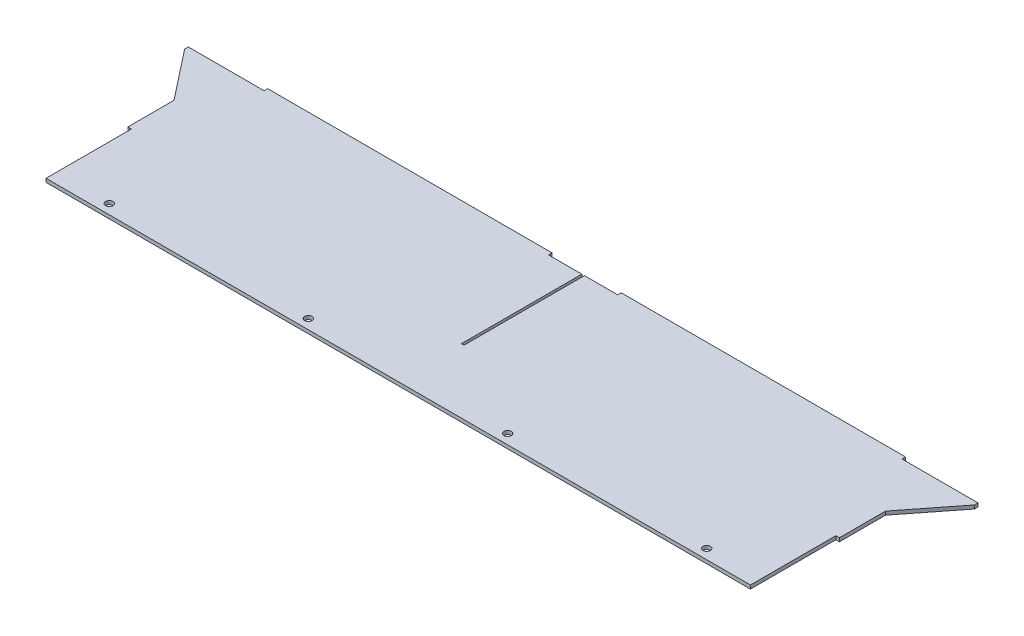
ISO-10303-21;
HEADER;
FILE_DESCRIPTION(('STEP AP214'),'2;1');
FILE_NAME('part.step','',(''),(''),'','','');
FILE_SCHEMA(('AUTOMOTIVE_DESIGN { 1 0 10303 214 1 1 1 1 }'));
ENDSEC;
DATA;
#1=APPLICATION_CONTEXT('core data for automotive mechanical design processes');
#2=APPLICATION_PROTOCOL_DEFINITION('international standard','automotive_design',2000,#1);
#3=PRODUCT_CONTEXT('',#1,'mechanical');
#4=PRODUCT('Part','Part','',(#3));
#5=PRODUCT_RELATED_PRODUCT_CATEGORY('part','',(#4));
#6=PRODUCT_DEFINITION_FORMATION('','',#4);
#7=PRODUCT_DEFINITION_CONTEXT('part definition',#1,'design');
#8=PRODUCT_DEFINITION('design','',#6,#7);
#9=PRODUCT_DEFINITION_SHAPE('','',#8);
#10=(LENGTH_UNIT() NAMED_UNIT(*) SI_UNIT(.MILLI.,.METRE.));
#11=(NAMED_UNIT(*) PLANE_ANGLE_UNIT() SI_UNIT($,.RADIAN.));
#12=(NAMED_UNIT(*) SI_UNIT($,.STERADIAN.) SOLID_ANGLE_UNIT());
#13=UNCERTAINTY_MEASURE_WITH_UNIT(LENGTH_MEASURE(1.E-05),#10,'distance_accuracy_value','');
#14=(GEOMETRIC_REPRESENTATION_CONTEXT(3) GLOBAL_UNCERTAINTY_ASSIGNED_CONTEXT((#13)) GLOBAL_UNIT_ASSIGNED_CONTEXT((#10,
#11,#12)) REPRESENTATION_CONTEXT('',''));
#15=CARTESIAN_POINT('',(0.,0.,0.));
#16=DIRECTION('',(0.,0.,1.));
#17=DIRECTION('',(1.,0.,0.));
#18=AXIS2_PLACEMENT_3D('',#15,#16,#17);
#19=CARTESIAN_POINT('',(-266.7,1.5875,73.8124000000001));
#20=DIRECTION('',(0.,1.,0.));
#21=DIRECTION('',(0.,0.,1.));
#22=AXIS2_PLACEMENT_3D('',#19,#20,#21);
#23=CYLINDRICAL_SURFACE('',#22,3.3);
#24=CARTESIAN_POINT('',(-266.7,-1.58750000000007,73.8124000000001));
#25=DIRECTION('',(0.,1.,0.));
#26=DIRECTION('',(0.,0.,1.));
#27=AXIS2_PLACEMENT_3D('',#24,#25,#26);
#28=CIRCLE('',#27,3.30000000000003);
#29=CARTESIAN_POINT('',(-266.7,-1.58750000000007,77.1124000000001));
#30=VERTEX_POINT('',#29);
#31=EDGE_CURVE('E43',#30,#30,#28,.T.);
#32=ORIENTED_EDGE('',*,*,#31,.F.);
#33=EDGE_LOOP('',(#32));
#34=FACE_BOUND('',#33,.T.);
#35=CARTESIAN_POINT('',(-266.7,1.5875,73.8124000000001));
#36=DIRECTION('',(0.,1.,0.));
#37=DIRECTION('',(0.,0.,1.));
#38=AXIS2_PLACEMENT_3D('',#35,#36,#37);
#39=CIRCLE('',#38,3.29999999999997);
#40=CARTESIAN_POINT('',(-266.7,1.5875,77.1124000000001));
#41=VERTEX_POINT('',#40);
#42=EDGE_CURVE('E11',#41,#41,#39,.T.);
#43=ORIENTED_EDGE('',*,*,#42,.T.);
#44=EDGE_LOOP('',(#43));
#45=FACE_BOUND('',#44,.T.);
#46=ADVANCED_FACE('F36',(#34,#45),#23,.F.);
#47=CARTESIAN_POINT('',(-88.8999999999999,1.5875,73.8124000000001));
#48=DIRECTION('',(0.,1.,0.));
#49=DIRECTION('',(0.,0.,1.));
#50=AXIS2_PLACEMENT_3D('',#47,#48,#49);
#51=CYLINDRICAL_SURFACE('',#50,3.3);
#52=CARTESIAN_POINT('',(-88.8999999999999,-1.58750000000007,73.8124000000001));
#53=DIRECTION('',(0.,1.,0.));
#54=DIRECTION('',(0.,0.,1.));
#55=AXIS2_PLACEMENT_3D('',#52,#53,#54);
#56=CIRCLE('',#55,3.30000000000003);
#57=CARTESIAN_POINT('',(-88.8999999999999,-1.58750000000007,77.1124000000001));
#58=VERTEX_POINT('',#57);
#59=EDGE_CURVE('E223',#58,#58,#56,.T.);
#60=ORIENTED_EDGE('',*,*,#59,.F.);
#61=EDGE_LOOP('',(#60));
#62=FACE_BOUND('',#61,.T.);
#63=CARTESIAN_POINT('',(-88.8999999999999,1.5875,73.8124000000001));
#64=DIRECTION('',(0.,1.,0.));
#65=DIRECTION('',(0.,0.,1.));
#66=AXIS2_PLACEMENT_3D('',#63,#64,#65);
#67=CIRCLE('',#66,3.29999999999997);
#68=CARTESIAN_POINT('',(-88.8999999999999,1.5875,77.1124000000001));
#69=VERTEX_POINT('',#68);
#70=EDGE_CURVE('E227',#69,#69,#67,.T.);
#71=ORIENTED_EDGE('',*,*,#70,.T.);
#72=EDGE_LOOP('',(#71));
#73=FACE_BOUND('',#72,.T.);
#74=ADVANCED_FACE('F255',(#62,#73),#51,.F.);
#75=CARTESIAN_POINT('',(317.6778,1.5875,-82.55));
#76=DIRECTION('',(-1.,0.,0.));
#77=DIRECTION('',(0.,0.,1.));
#78=AXIS2_PLACEMENT_3D('',#75,#76,#77);
#79=PLANE('',#78);
#80=DIRECTION('',(0.,-1.,0.));
#81=VECTOR('',#80,1.);
#82=CARTESIAN_POINT('',(317.6778,1.5875,6.35000000000007));
#83=LINE('',#82,#81);
#84=CARTESIAN_POINT('',(317.6778,1.5875,6.35000000000007));
#85=VERTEX_POINT('',#84);
#86=CARTESIAN_POINT('',(317.6778,-1.5875,6.35000000000007));
#87=VERTEX_POINT('',#86);
#88=EDGE_CURVE('E692',#85,#87,#83,.T.);
#89=ORIENTED_EDGE('',*,*,#88,.T.);
#90=DIRECTION('',(0.,0.,-1.));
#91=VECTOR('',#90,1.);
#92=CARTESIAN_POINT('',(317.6778,-1.5875,-82.55));
#93=LINE('',#92,#91);
#94=CARTESIAN_POINT('',(317.6778,-1.5875,-34.925));
#95=VERTEX_POINT('',#94);
#96=EDGE_CURVE('E233',#87,#95,#93,.T.);
#97=ORIENTED_EDGE('',*,*,#96,.T.);
#98=DIRECTION('',(0.,-1.,0.));
#99=VECTOR('',#98,1.);
#100=CARTESIAN_POINT('',(317.6778,1.5875,-34.925));
#101=LINE('',#100,#99);
#102=CARTESIAN_POINT('',(317.6778,1.5875,-34.925));
#103=VERTEX_POINT('',#102);
#104=EDGE_CURVE('E657',#103,#95,#101,.T.);
#105=ORIENTED_EDGE('',*,*,#104,.F.);
#106=DIRECTION('',(0.,0.,-1.));
#107=VECTOR('',#106,1.);
#108=CARTESIAN_POINT('',(317.6778,1.5875,-82.55));
#109=LINE('',#108,#107);
#110=EDGE_CURVE('E245',#85,#103,#109,.T.);
#111=ORIENTED_EDGE('',*,*,#110,.F.);
#112=EDGE_LOOP('',(#89,#97,#105,#111));
#113=FACE_BOUND('',#112,.T.);
#114=ADVANCED_FACE('F285',(#113),#79,.F.);
#115=CARTESIAN_POINT('',(-317.6778,1.5875,-82.55));
#116=DIRECTION('',(0.,0.,1.));
#117=DIRECTION('',(1.,0.,0.));
#118=AXIS2_PLACEMENT_3D('',#115,#116,#117);
#119=PLANE('',#118);
#120=DIRECTION('',(0.,-1.,0.));
#121=VECTOR('',#120,1.);
#122=CARTESIAN_POINT('',(-1.14299999999998,1.5875,-82.55));
#123=LINE('',#122,#121);
#124=CARTESIAN_POINT('',(-1.14299999999998,1.5875,-82.55));
#125=VERTEX_POINT('',#124);
#126=CARTESIAN_POINT('',(-1.14299999999998,-1.5875,-82.55));
#127=VERTEX_POINT('',#126);
#128=EDGE_CURVE('E625',#125,#127,#123,.T.);
#129=ORIENTED_EDGE('',*,*,#128,.T.);
#130=DIRECTION('',(-1.,0.,0.));
#131=VECTOR('',#130,1.);
#132=CARTESIAN_POINT('',(-317.6778,-1.5875,-82.55));
#133=LINE('',#132,#131);
#134=CARTESIAN_POINT('',(-30.8229000000015,-1.5875,-82.55));
#135=VERTEX_POINT('',#134);
#136=EDGE_CURVE('E241',#127,#135,#133,.T.);
#137=ORIENTED_EDGE('',*,*,#136,.T.);
#138=DIRECTION('',(0.,-1.,0.));
#139=VECTOR('',#138,1.);
#140=CARTESIAN_POINT('',(-30.8229000000015,-1.58750000000007,-82.55));
#141=LINE('',#140,#139);
#142=CARTESIAN_POINT('',(-30.8229000000015,1.5875,-82.55));
#143=VERTEX_POINT('',#142);
#144=EDGE_CURVE('E551',#143,#135,#141,.T.);
#145=ORIENTED_EDGE('',*,*,#144,.F.);
#146=DIRECTION('',(-1.,0.,0.));
#147=VECTOR('',#146,1.);
#148=CARTESIAN_POINT('',(-317.6778,1.5875,-82.55));
#149=LINE('',#148,#147);
#150=EDGE_CURVE('E567',#125,#143,#149,.T.);
#151=ORIENTED_EDGE('',*,*,#150,.F.);
#152=EDGE_LOOP('',(#129,#137,#145,#151));
#153=FACE_BOUND('',#152,.T.);
#154=ADVANCED_FACE('F268',(#153),#119,.F.);
#155=CARTESIAN_POINT('',(-317.6778,1.5875,82.55));
#156=DIRECTION('',(0.,0.,-1.));
#157=DIRECTION('',(-1.,0.,0.));
#158=AXIS2_PLACEMENT_3D('',#155,#156,#157);
#159=PLANE('',#158);
#160=DIRECTION('',(1.,0.,0.));
#161=VECTOR('',#160,1.);
#162=CARTESIAN_POINT('',(-317.6778,-1.5875,82.55));
#163=LINE('',#162,#161);
#164=CARTESIAN_POINT('',(-314.5028,-1.5875,82.55));
#165=VERTEX_POINT('',#164);
#166=CARTESIAN_POINT('',(314.5028,-1.5875,82.55));
#167=VERTEX_POINT('',#166);
#168=EDGE_CURVE('E244',#165,#167,#163,.T.);
#169=ORIENTED_EDGE('',*,*,#168,.T.);
#170=DIRECTION('',(0.,-1.,0.));
#171=VECTOR('',#170,1.);
#172=CARTESIAN_POINT('',(314.5028,1.5875,82.55));
#173=LINE('',#172,#171);
#174=CARTESIAN_POINT('',(314.5028,1.5875,82.55));
#175=VERTEX_POINT('',#174);
#176=EDGE_CURVE('E222',#175,#167,#173,.T.);
#177=ORIENTED_EDGE('',*,*,#176,.F.);
#178=DIRECTION('',(1.,0.,0.));
#179=VECTOR('',#178,1.);
#180=CARTESIAN_POINT('',(-317.6778,1.5875,82.55));
#181=LINE('',#180,#179);
#182=CARTESIAN_POINT('',(-314.5028,1.5875,82.55));
#183=VERTEX_POINT('',#182);
#184=EDGE_CURVE('E216',#183,#175,#181,.T.);
#185=ORIENTED_EDGE('',*,*,#184,.F.);
#186=DIRECTION('',(0.,-1.,0.));
#187=VECTOR('',#186,1.);
#188=CARTESIAN_POINT('',(-314.5028,1.5875,82.55));
#189=LINE('',#188,#187);
#190=EDGE_CURVE('E197',#183,#165,#189,.T.);
#191=ORIENTED_EDGE('',*,*,#190,.T.);
#192=EDGE_LOOP('',(#169,#177,#185,#191));
#193=FACE_BOUND('',#192,.T.);
#194=ADVANCED_FACE('F221',(#193),#159,.F.);
#195=CARTESIAN_POINT('',(0.,1.5875,0.));
#196=DIRECTION('',(0.,1.,0.));
#197=DIRECTION('',(0.,0.,1.));
#198=AXIS2_PLACEMENT_3D('',#195,#196,#197);
#199=PLANE('',#198);
#200=CARTESIAN_POINT('',(88.9000000000001,1.5875,73.8124000000001));
#201=DIRECTION('',(0.,1.,0.));
#202=DIRECTION('',(0.,0.,1.));
#203=AXIS2_PLACEMENT_3D('',#200,#201,#202);
#204=CIRCLE('',#203,3.29999999999997);
#205=CARTESIAN_POINT('',(88.9000000000001,1.5875,77.1124000000001));
#206=VERTEX_POINT('',#205);
#207=EDGE_CURVE('E725',#206,#206,#204,.T.);
#208=ORIENTED_EDGE('',*,*,#207,.F.);
#209=EDGE_LOOP('',(#208));
#210=FACE_BOUND('',#209,.T.);
#211=CARTESIAN_POINT('',(266.7,1.5875,73.8124000000001));
#212=DIRECTION('',(0.,1.,0.));
#213=DIRECTION('',(0.,0.,1.));
#214=AXIS2_PLACEMENT_3D('',#211,#212,#213);
#215=CIRCLE('',#214,3.29999999999997);
#216=CARTESIAN_POINT('',(266.7,1.5875,77.1124000000001));
#217=VERTEX_POINT('',#216);
#218=EDGE_CURVE('E722',#217,#217,#215,.T.);
#219=ORIENTED_EDGE('',*,*,#218,.F.);
#220=EDGE_LOOP('',(#219));
#221=FACE_BOUND('',#220,.T.);
#222=DIRECTION('',(0.,0.,-1.));
#223=VECTOR('',#222,1.);
#224=CARTESIAN_POINT('',(314.5028,1.5875,0.));
#225=LINE('',#224,#223);
#226=CARTESIAN_POINT('',(314.5028,1.5875,6.35000000000006));
#227=VERTEX_POINT('',#226);
#228=EDGE_CURVE('E697',#175,#227,#225,.T.);
#229=ORIENTED_EDGE('',*,*,#228,.T.);
#230=DIRECTION('',(-1.,0.,0.));
#231=VECTOR('',#230,1.);
#232=CARTESIAN_POINT('',(0.,1.5875,6.34999999999998));
#233=LINE('',#232,#231);
#234=EDGE_CURVE('E699',#85,#227,#233,.T.);
#235=ORIENTED_EDGE('',*,*,#234,.F.);
#236=ORIENTED_EDGE('',*,*,#110,.T.);
#237=DIRECTION('',(-0.617821551931904,0.,0.786318338822422));
#238=VECTOR('',#237,1.);
#239=CARTESIAN_POINT('',(352.6028,1.5875,-79.375));
#240=LINE('',#239,#238);
#241=CARTESIAN_POINT('',(352.6028,1.5875,-79.375));
#242=VERTEX_POINT('',#241);
#243=EDGE_CURVE('E648',#242,#103,#240,.T.);
#244=ORIENTED_EDGE('',*,*,#243,.F.);
#245=DIRECTION('',(0.,0.,1.));
#246=VECTOR('',#245,1.);
#247=CARTESIAN_POINT('',(352.6028,1.5875,-82.55));
#248=LINE('',#247,#246);
#249=CARTESIAN_POINT('',(352.6028,1.5875,-82.55));
#250=VERTEX_POINT('',#249);
#251=EDGE_CURVE('E645',#250,#242,#248,.T.);
#252=ORIENTED_EDGE('',*,*,#251,.F.);
#253=CARTESIAN_POINT('',(284.822900000001,1.5875,-82.55));
#254=VERTEX_POINT('',#253);
#255=EDGE_CURVE('E229',#250,#254,#149,.T.);
#256=ORIENTED_EDGE('',*,*,#255,.T.);
#257=DIRECTION('',(0.,0.,1.));
#258=VECTOR('',#257,1.);
#259=CARTESIAN_POINT('',(284.822900000001,1.58749999999994,-85.725));
#260=LINE('',#259,#258);
#261=CARTESIAN_POINT('',(284.822900000001,1.58749999999994,-85.725));
#262=VERTEX_POINT('',#261);
#263=EDGE_CURVE('E674',#262,#254,#260,.T.);
#264=ORIENTED_EDGE('',*,*,#263,.F.);
#265=DIRECTION('',(1.,0.,0.));
#266=VECTOR('',#265,1.);
#267=CARTESIAN_POINT('',(284.822900000001,1.58749999999994,-85.725));
#268=LINE('',#267,#266);
#269=CARTESIAN_POINT('',(30.8229000000015,1.58749999999994,-85.725));
#270=VERTEX_POINT('',#269);
#271=EDGE_CURVE('E672',#270,#262,#268,.T.);
#272=ORIENTED_EDGE('',*,*,#271,.F.);
#273=DIRECTION('',(0.,0.,1.));
#274=VECTOR('',#273,1.);
#275=CARTESIAN_POINT('',(30.8229000000015,1.58749999999994,-85.725));
#276=LINE('',#275,#274);
#277=CARTESIAN_POINT('',(30.8229000000014,1.5875,-82.55));
#278=VERTEX_POINT('',#277);
#279=EDGE_CURVE('E679',#270,#278,#276,.T.);
#280=ORIENTED_EDGE('',*,*,#279,.T.);
#281=CARTESIAN_POINT('',(1.14300000000002,1.5875,-82.55));
#282=VERTEX_POINT('',#281);
#283=EDGE_CURVE('E566',#278,#282,#149,.T.);
#284=ORIENTED_EDGE('',*,*,#283,.T.);
#285=DIRECTION('',(0.,0.,1.));
#286=VECTOR('',#285,1.);
#287=CARTESIAN_POINT('',(1.14300000000002,1.5875,0.));
#288=LINE('',#287,#286);
#289=CARTESIAN_POINT('',(1.14300000000002,1.5875,24.892));
#290=VERTEX_POINT('',#289);
#291=EDGE_CURVE('E629',#282,#290,#288,.T.);
#292=ORIENTED_EDGE('',*,*,#291,.T.);
#293=DIRECTION('',(1.,0.,0.));
#294=VECTOR('',#293,1.);
#295=CARTESIAN_POINT('',(0.,1.5875,24.892));
#296=LINE('',#295,#294);
#297=CARTESIAN_POINT('',(-1.14299999999998,1.5875,24.892));
#298=VERTEX_POINT('',#297);
#299=EDGE_CURVE('E614',#298,#290,#296,.T.);
#300=ORIENTED_EDGE('',*,*,#299,.F.);
#301=DIRECTION('',(0.,0.,1.));
#302=VECTOR('',#301,1.);
#303=CARTESIAN_POINT('',(-1.14299999999998,1.5875,0.));
#304=LINE('',#303,#302);
#305=EDGE_CURVE('E577',#125,#298,#304,.T.);
#306=ORIENTED_EDGE('',*,*,#305,.F.);
#307=ORIENTED_EDGE('',*,*,#150,.T.);
#308=DIRECTION('',(0.,0.,1.));
#309=VECTOR('',#308,1.);
#310=CARTESIAN_POINT('',(-30.8229000000015,1.58749999999994,-85.725));
#311=LINE('',#310,#309);
#312=CARTESIAN_POINT('',(-30.8229000000015,1.58749999999994,-85.725));
#313=VERTEX_POINT('',#312);
#314=EDGE_CURVE('E557',#313,#143,#311,.T.);
#315=ORIENTED_EDGE('',*,*,#314,.F.);
#316=DIRECTION('',(1.,0.,0.));
#317=VECTOR('',#316,1.);
#318=CARTESIAN_POINT('',(-30.8229000000015,1.58749999999994,-85.725));
#319=LINE('',#318,#317);
#320=CARTESIAN_POINT('',(-284.822900000001,1.58749999999994,-85.725));
#321=VERTEX_POINT('',#320);
#322=EDGE_CURVE('E556',#321,#313,#319,.T.);
#323=ORIENTED_EDGE('',*,*,#322,.F.);
#324=DIRECTION('',(0.,0.,1.));
#325=VECTOR('',#324,1.);
#326=CARTESIAN_POINT('',(-284.822900000001,1.58749999999994,-85.725));
#327=LINE('',#326,#325);
#328=CARTESIAN_POINT('',(-284.822900000001,1.58749999999994,-82.55));
#329=VERTEX_POINT('',#328);
#330=EDGE_CURVE('E545',#321,#329,#327,.T.);
#331=ORIENTED_EDGE('',*,*,#330,.T.);
#332=CARTESIAN_POINT('',(-352.6028,1.5875,-82.55));
#333=VERTEX_POINT('',#332);
#334=EDGE_CURVE('E553',#329,#333,#149,.T.);
#335=ORIENTED_EDGE('',*,*,#334,.T.);
#336=DIRECTION('',(0.,0.,1.));
#337=VECTOR('',#336,1.);
#338=CARTESIAN_POINT('',(-352.6028,1.5875,-82.55));
#339=LINE('',#338,#337);
#340=CARTESIAN_POINT('',(-352.6028,1.5875,-79.375));
#341=VERTEX_POINT('',#340);
#342=EDGE_CURVE('E632',#333,#341,#339,.T.);
#343=ORIENTED_EDGE('',*,*,#342,.T.);
#344=DIRECTION('',(0.617821551931904,0.,0.786318338822422));
#345=VECTOR('',#344,1.);
#346=CARTESIAN_POINT('',(-352.6028,1.5875,-79.375));
#347=LINE('',#346,#345);
#348=CARTESIAN_POINT('',(-317.6778,1.5875,-34.925));
#349=VERTEX_POINT('',#348);
#350=EDGE_CURVE('E630',#341,#349,#347,.T.);
#351=ORIENTED_EDGE('',*,*,#350,.T.);
#352=DIRECTION('',(0.,0.,1.));
#353=VECTOR('',#352,1.);
#354=CARTESIAN_POINT('',(-317.6778,1.5875,-82.55));
#355=LINE('',#354,#353);
#356=CARTESIAN_POINT('',(-317.6778,1.5875,6.34999999999999));
#357=VERTEX_POINT('',#356);
#358=EDGE_CURVE('E224',#349,#357,#355,.T.);
#359=ORIENTED_EDGE('',*,*,#358,.T.);
#360=DIRECTION('',(1.,0.,0.));
#361=VECTOR('',#360,1.);
#362=CARTESIAN_POINT('',(0.,1.5875,6.34999999999999));
#363=LINE('',#362,#361);
#364=CARTESIAN_POINT('',(-314.5028,1.5875,6.34999999999999));
#365=VERTEX_POINT('',#364);
#366=EDGE_CURVE('E208',#357,#365,#363,.T.);
#367=ORIENTED_EDGE('',*,*,#366,.T.);
#368=DIRECTION('',(0.,0.,-1.));
#369=VECTOR('',#368,1.);
#370=CARTESIAN_POINT('',(-314.5028,1.5875,0.));
#371=LINE('',#370,#369);
#372=EDGE_CURVE('E200',#183,#365,#371,.T.);
#373=ORIENTED_EDGE('',*,*,#372,.F.);
#374=ORIENTED_EDGE('',*,*,#184,.T.);
#375=EDGE_LOOP('',(#229,#235,#236,#244,#252,#256,#264,#272,#280,#284,#292,#300,#306,#307,#315,
#323,#331,#335,#343,#351,#359,#367,#373,#374));
#376=FACE_BOUND('',#375,.T.);
#377=ORIENTED_EDGE('',*,*,#70,.F.);
#378=EDGE_LOOP('',(#377));
#379=FACE_BOUND('',#378,.T.);
#380=ORIENTED_EDGE('',*,*,#42,.F.);
#381=EDGE_LOOP('',(#380));
#382=FACE_BOUND('',#381,.T.);
#383=ADVANCED_FACE('F214',(#210,#221,#376,#379,#382),#199,.T.);
#384=CARTESIAN_POINT('',(0.,-1.5875,0.));
#385=DIRECTION('',(0.,1.,0.));
#386=DIRECTION('',(0.,0.,1.));
#387=AXIS2_PLACEMENT_3D('',#384,#385,#386);
#388=PLANE('',#387);
#389=CARTESIAN_POINT('',(88.9000000000001,-1.58750000000007,73.8124000000001));
#390=DIRECTION('',(0.,1.,0.));
#391=DIRECTION('',(0.,0.,1.));
#392=AXIS2_PLACEMENT_3D('',#389,#390,#391);
#393=CIRCLE('',#392,3.30000000000003);
#394=CARTESIAN_POINT('',(88.9000000000001,-1.58750000000007,77.1124000000001));
#395=VERTEX_POINT('',#394);
#396=EDGE_CURVE('E728',#395,#395,#393,.T.);
#397=ORIENTED_EDGE('',*,*,#396,.T.);
#398=EDGE_LOOP('',(#397));
#399=FACE_BOUND('',#398,.T.);
#400=CARTESIAN_POINT('',(266.7,-1.58750000000007,73.8124000000001));
#401=DIRECTION('',(0.,1.,0.));
#402=DIRECTION('',(0.,0.,1.));
#403=AXIS2_PLACEMENT_3D('',#400,#401,#402);
#404=CIRCLE('',#403,3.30000000000003);
#405=CARTESIAN_POINT('',(266.7,-1.58750000000007,77.1124000000001));
#406=VERTEX_POINT('',#405);
#407=EDGE_CURVE('E701',#406,#406,#404,.T.);
#408=ORIENTED_EDGE('',*,*,#407,.T.);
#409=EDGE_LOOP('',(#408));
#410=FACE_BOUND('',#409,.T.);
#411=DIRECTION('',(-1.,0.,0.));
#412=VECTOR('',#411,1.);
#413=CARTESIAN_POINT('',(0.,-1.5875,6.34999999999998));
#414=LINE('',#413,#412);
#415=CARTESIAN_POINT('',(314.5028,-1.5875,6.35000000000006));
#416=VERTEX_POINT('',#415);
#417=EDGE_CURVE('E694',#87,#416,#414,.T.);
#418=ORIENTED_EDGE('',*,*,#417,.T.);
#419=DIRECTION('',(0.,0.,-1.));
#420=VECTOR('',#419,1.);
#421=CARTESIAN_POINT('',(314.5028,-1.5875,0.));
#422=LINE('',#421,#420);
#423=EDGE_CURVE('E696',#167,#416,#422,.T.);
#424=ORIENTED_EDGE('',*,*,#423,.F.);
#425=ORIENTED_EDGE('',*,*,#168,.F.);
#426=DIRECTION('',(0.,0.,-1.));
#427=VECTOR('',#426,1.);
#428=CARTESIAN_POINT('',(-314.5028,-1.5875,0.));
#429=LINE('',#428,#427);
#430=CARTESIAN_POINT('',(-314.5028,-1.5875,6.34999999999999));
#431=VERTEX_POINT('',#430);
#432=EDGE_CURVE('E203',#165,#431,#429,.T.);
#433=ORIENTED_EDGE('',*,*,#432,.T.);
#434=DIRECTION('',(1.,0.,0.));
#435=VECTOR('',#434,1.);
#436=CARTESIAN_POINT('',(0.,-1.5875,6.34999999999999));
#437=LINE('',#436,#435);
#438=CARTESIAN_POINT('',(-317.6778,-1.5875,6.34999999999998));
#439=VERTEX_POINT('',#438);
#440=EDGE_CURVE('E218',#439,#431,#437,.T.);
#441=ORIENTED_EDGE('',*,*,#440,.F.);
#442=DIRECTION('',(0.,0.,1.));
#443=VECTOR('',#442,1.);
#444=CARTESIAN_POINT('',(-317.6778,-1.5875,-82.55));
#445=LINE('',#444,#443);
#446=CARTESIAN_POINT('',(-317.6778,-1.5875,-34.925));
#447=VERTEX_POINT('',#446);
#448=EDGE_CURVE('E239',#447,#439,#445,.T.);
#449=ORIENTED_EDGE('',*,*,#448,.F.);
#450=DIRECTION('',(0.617821551931904,0.,0.786318338822422));
#451=VECTOR('',#450,1.);
#452=CARTESIAN_POINT('',(-352.6028,-1.5875,-79.375));
#453=LINE('',#452,#451);
#454=CARTESIAN_POINT('',(-352.6028,-1.5875,-79.375));
#455=VERTEX_POINT('',#454);
#456=EDGE_CURVE('E623',#455,#447,#453,.T.);
#457=ORIENTED_EDGE('',*,*,#456,.F.);
#458=DIRECTION('',(0.,0.,1.));
#459=VECTOR('',#458,1.);
#460=CARTESIAN_POINT('',(-352.6028,-1.5875,-82.55));
#461=LINE('',#460,#459);
#462=CARTESIAN_POINT('',(-352.6028,-1.5875,-82.55));
#463=VERTEX_POINT('',#462);
#464=EDGE_CURVE('E597',#463,#455,#461,.T.);
#465=ORIENTED_EDGE('',*,*,#464,.F.);
#466=CARTESIAN_POINT('',(-284.822900000001,-1.5875,-82.55));
#467=VERTEX_POINT('',#466);
#468=EDGE_CURVE('E235',#467,#463,#133,.T.);
#469=ORIENTED_EDGE('',*,*,#468,.F.);
#470=DIRECTION('',(0.,0.,1.));
#471=VECTOR('',#470,1.);
#472=CARTESIAN_POINT('',(-284.822900000001,-1.58750000000007,-85.725));
#473=LINE('',#472,#471);
#474=CARTESIAN_POINT('',(-284.822900000001,-1.58750000000007,-85.725));
#475=VERTEX_POINT('',#474);
#476=EDGE_CURVE('E548',#475,#467,#473,.T.);
#477=ORIENTED_EDGE('',*,*,#476,.F.);
#478=DIRECTION('',(-1.,0.,0.));
#479=VECTOR('',#478,1.);
#480=CARTESIAN_POINT('',(-30.8229000000015,-1.58750000000007,-85.725));
#481=LINE('',#480,#479);
#482=CARTESIAN_POINT('',(-30.8229000000015,-1.58750000000007,-85.725));
#483=VERTEX_POINT('',#482);
#484=EDGE_CURVE('E585',#483,#475,#481,.T.);
#485=ORIENTED_EDGE('',*,*,#484,.F.);
#486=DIRECTION('',(0.,0.,1.));
#487=VECTOR('',#486,1.);
#488=CARTESIAN_POINT('',(-30.8229000000015,-1.58750000000007,-85.725));
#489=LINE('',#488,#487);
#490=EDGE_CURVE('E236',#483,#135,#489,.T.);
#491=ORIENTED_EDGE('',*,*,#490,.T.);
#492=ORIENTED_EDGE('',*,*,#136,.F.);
#493=DIRECTION('',(0.,0.,1.));
#494=VECTOR('',#493,1.);
#495=CARTESIAN_POINT('',(-1.14299999999998,-1.5875,0.));
#496=LINE('',#495,#494);
#497=CARTESIAN_POINT('',(-1.14299999999998,-1.5875,24.892));
#498=VERTEX_POINT('',#497);
#499=EDGE_CURVE('E615',#127,#498,#496,.T.);
#500=ORIENTED_EDGE('',*,*,#499,.T.);
#501=DIRECTION('',(1.,0.,0.));
#502=VECTOR('',#501,1.);
#503=CARTESIAN_POINT('',(0.,-1.5875,24.892));
#504=LINE('',#503,#502);
#505=CARTESIAN_POINT('',(1.14300000000002,-1.5875,24.892));
#506=VERTEX_POINT('',#505);
#507=EDGE_CURVE('E50',#498,#506,#504,.T.);
#508=ORIENTED_EDGE('',*,*,#507,.T.);
#509=DIRECTION('',(0.,0.,1.));
#510=VECTOR('',#509,1.);
#511=CARTESIAN_POINT('',(1.14300000000002,-1.5875,0.));
#512=LINE('',#511,#510);
#513=CARTESIAN_POINT('',(1.14300000000002,-1.5875,-82.55));
#514=VERTEX_POINT('',#513);
#515=EDGE_CURVE('E611',#514,#506,#512,.T.);
#516=ORIENTED_EDGE('',*,*,#515,.F.);
#517=CARTESIAN_POINT('',(30.8229000000015,-1.58750000000007,-82.55));
#518=VERTEX_POINT('',#517);
#519=EDGE_CURVE('E240',#518,#514,#133,.T.);
#520=ORIENTED_EDGE('',*,*,#519,.F.);
#521=DIRECTION('',(0.,0.,1.));
#522=VECTOR('',#521,1.);
#523=CARTESIAN_POINT('',(30.8229000000015,-1.58750000000007,-85.725));
#524=LINE('',#523,#522);
#525=CARTESIAN_POINT('',(30.8229000000015,-1.58750000000007,-85.725));
#526=VERTEX_POINT('',#525);
#527=EDGE_CURVE('E608',#526,#518,#524,.T.);
#528=ORIENTED_EDGE('',*,*,#527,.F.);
#529=DIRECTION('',(-1.,0.,0.));
#530=VECTOR('',#529,1.);
#531=CARTESIAN_POINT('',(284.822900000001,-1.58750000000007,-85.725));
#532=LINE('',#531,#530);
#533=CARTESIAN_POINT('',(284.822900000001,-1.58750000000007,-85.725));
#534=VERTEX_POINT('',#533);
#535=EDGE_CURVE('E668',#534,#526,#532,.T.);
#536=ORIENTED_EDGE('',*,*,#535,.F.);
#537=DIRECTION('',(0.,0.,1.));
#538=VECTOR('',#537,1.);
#539=CARTESIAN_POINT('',(284.822900000001,-1.58750000000007,-85.725));
#540=LINE('',#539,#538);
#541=CARTESIAN_POINT('',(284.822900000001,-1.5875,-82.55));
#542=VERTEX_POINT('',#541);
#543=EDGE_CURVE('E582',#534,#542,#540,.T.);
#544=ORIENTED_EDGE('',*,*,#543,.T.);
#545=CARTESIAN_POINT('',(352.6028,-1.5875,-82.55));
#546=VERTEX_POINT('',#545);
#547=EDGE_CURVE('E237',#546,#542,#133,.T.);
#548=ORIENTED_EDGE('',*,*,#547,.F.);
#549=DIRECTION('',(0.,0.,1.));
#550=VECTOR('',#549,1.);
#551=CARTESIAN_POINT('',(352.6028,-1.5875,-82.55));
#552=LINE('',#551,#550);
#553=CARTESIAN_POINT('',(352.6028,-1.5875,-79.375));
#554=VERTEX_POINT('',#553);
#555=EDGE_CURVE('E639',#546,#554,#552,.T.);
#556=ORIENTED_EDGE('',*,*,#555,.T.);
#557=DIRECTION('',(-0.617821551931904,0.,0.786318338822422));
#558=VECTOR('',#557,1.);
#559=CARTESIAN_POINT('',(352.6028,-1.5875,-79.375));
#560=LINE('',#559,#558);
#561=EDGE_CURVE('E649',#554,#95,#560,.T.);
#562=ORIENTED_EDGE('',*,*,#561,.T.);
#563=ORIENTED_EDGE('',*,*,#96,.F.);
#564=EDGE_LOOP('',(#418,#424,#425,#433,#441,#449,#457,#465,#469,#477,#485,#491,#492,#500,#508,
#516,#520,#528,#536,#544,#548,#556,#562,#563));
#565=FACE_BOUND('',#564,.T.);
#566=ORIENTED_EDGE('',*,*,#59,.T.);
#567=EDGE_LOOP('',(#566));
#568=FACE_BOUND('',#567,.T.);
#569=ORIENTED_EDGE('',*,*,#31,.T.);
#570=EDGE_LOOP('',(#569));
#571=FACE_BOUND('',#570,.T.);
#572=ADVANCED_FACE('F251',(#399,#410,#565,#568,#571),#388,.F.);
#573=DIRECTION('',(0.,-1.,0.));
#574=VECTOR('',#573,1.);
#575=CARTESIAN_POINT('',(284.822900000001,-1.58750000000007,-82.55));
#576=LINE('',#575,#574);
#577=EDGE_CURVE('E660',#254,#542,#576,.T.);
#578=ORIENTED_EDGE('',*,*,#577,.F.);
#579=ORIENTED_EDGE('',*,*,#255,.F.);
#580=DIRECTION('',(0.,-1.,0.));
#581=VECTOR('',#580,1.);
#582=CARTESIAN_POINT('',(352.6028,1.5875,-82.55));
#583=LINE('',#582,#581);
#584=EDGE_CURVE('E652',#250,#546,#583,.T.);
#585=ORIENTED_EDGE('',*,*,#584,.T.);
#586=ORIENTED_EDGE('',*,*,#547,.T.);
#587=EDGE_LOOP('',(#578,#579,#585,#586));
#588=FACE_BOUND('',#587,.T.);
#589=ADVANCED_FACE('F265',(#588),#119,.F.);
#590=ORIENTED_EDGE('',*,*,#519,.T.);
#591=DIRECTION('',(0.,-1.,0.));
#592=VECTOR('',#591,1.);
#593=CARTESIAN_POINT('',(1.14300000000002,1.5875,-82.55));
#594=LINE('',#593,#592);
#595=EDGE_CURVE('E602',#282,#514,#594,.T.);
#596=ORIENTED_EDGE('',*,*,#595,.F.);
#597=ORIENTED_EDGE('',*,*,#283,.F.);
#598=DIRECTION('',(0.,1.,0.));
#599=VECTOR('',#598,1.);
#600=CARTESIAN_POINT('',(30.8229000000015,1.58749999999994,-82.55));
#601=LINE('',#600,#599);
#602=EDGE_CURVE('E604',#518,#278,#601,.T.);
#603=ORIENTED_EDGE('',*,*,#602,.F.);
#604=EDGE_LOOP('',(#590,#596,#597,#603));
#605=FACE_BOUND('',#604,.T.);
#606=ADVANCED_FACE('F283',(#605),#119,.F.);
#607=DIRECTION('',(0.,1.,0.));
#608=VECTOR('',#607,1.);
#609=CARTESIAN_POINT('',(-284.822900000001,1.58749999999994,-82.55));
#610=LINE('',#609,#608);
#611=EDGE_CURVE('E542',#467,#329,#610,.T.);
#612=ORIENTED_EDGE('',*,*,#611,.F.);
#613=ORIENTED_EDGE('',*,*,#468,.T.);
#614=DIRECTION('',(0.,-1.,0.));
#615=VECTOR('',#614,1.);
#616=CARTESIAN_POINT('',(-352.6028,1.5875,-82.55));
#617=LINE('',#616,#615);
#618=EDGE_CURVE('E637',#333,#463,#617,.T.);
#619=ORIENTED_EDGE('',*,*,#618,.F.);
#620=ORIENTED_EDGE('',*,*,#334,.F.);
#621=EDGE_LOOP('',(#612,#613,#619,#620));
#622=FACE_BOUND('',#621,.T.);
#623=ADVANCED_FACE('F279',(#622),#119,.F.);
#624=CARTESIAN_POINT('',(-317.6778,1.5875,-82.55));
#625=DIRECTION('',(1.,0.,0.));
#626=DIRECTION('',(0.,0.,-1.));
#627=AXIS2_PLACEMENT_3D('',#624,#625,#626);
#628=PLANE('',#627);
#629=ORIENTED_EDGE('',*,*,#448,.T.);
#630=DIRECTION('',(0.,-1.,0.));
#631=VECTOR('',#630,1.);
#632=CARTESIAN_POINT('',(-317.6778,1.5875,6.34999999999999));
#633=LINE('',#632,#631);
#634=EDGE_CURVE('E58',#357,#439,#633,.T.);
#635=ORIENTED_EDGE('',*,*,#634,.F.);
#636=ORIENTED_EDGE('',*,*,#358,.F.);
#637=DIRECTION('',(0.,-1.,0.));
#638=VECTOR('',#637,1.);
#639=CARTESIAN_POINT('',(-317.6778,1.5875,-34.925));
#640=LINE('',#639,#638);
#641=EDGE_CURVE('E634',#349,#447,#640,.T.);
#642=ORIENTED_EDGE('',*,*,#641,.T.);
#643=EDGE_LOOP('',(#629,#635,#636,#642));
#644=FACE_BOUND('',#643,.T.);
#645=ADVANCED_FACE('F276',(#644),#628,.F.);
#646=CARTESIAN_POINT('',(-30.8229000000015,-1.58750000000007,-85.725));
#647=DIRECTION('',(-1.,0.,0.));
#648=DIRECTION('',(0.,0.,1.));
#649=AXIS2_PLACEMENT_3D('',#646,#647,#648);
#650=PLANE('',#649);
#651=ORIENTED_EDGE('',*,*,#144,.T.);
#652=ORIENTED_EDGE('',*,*,#490,.F.);
#653=DIRECTION('',(0.,-1.,0.));
#654=VECTOR('',#653,1.);
#655=CARTESIAN_POINT('',(-30.8229000000015,-1.58750000000007,-85.725));
#656=LINE('',#655,#654);
#657=EDGE_CURVE('E550',#313,#483,#656,.T.);
#658=ORIENTED_EDGE('',*,*,#657,.F.);
#659=ORIENTED_EDGE('',*,*,#314,.T.);
#660=EDGE_LOOP('',(#651,#652,#658,#659));
#661=FACE_BOUND('',#660,.T.);
#662=ADVANCED_FACE('F273',(#661),#650,.F.);
#663=CARTESIAN_POINT('',(-284.822900000001,1.58749999999994,-85.725));
#664=DIRECTION('',(1.,0.,0.));
#665=DIRECTION('',(0.,1.,0.));
#666=AXIS2_PLACEMENT_3D('',#663,#664,#665);
#667=PLANE('',#666);
#668=ORIENTED_EDGE('',*,*,#611,.T.);
#669=ORIENTED_EDGE('',*,*,#330,.F.);
#670=DIRECTION('',(0.,1.,0.));
#671=VECTOR('',#670,1.);
#672=CARTESIAN_POINT('',(-284.822900000001,1.58749999999994,-85.725));
#673=LINE('',#672,#671);
#674=EDGE_CURVE('E587',#475,#321,#673,.T.);
#675=ORIENTED_EDGE('',*,*,#674,.F.);
#676=ORIENTED_EDGE('',*,*,#476,.T.);
#677=EDGE_LOOP('',(#668,#669,#675,#676));
#678=FACE_BOUND('',#677,.T.);
#679=ADVANCED_FACE('F532',(#678),#667,.F.);
#680=CARTESIAN_POINT('',(0.,0.,-85.725));
#681=DIRECTION('',(0.,0.,1.));
#682=DIRECTION('',(1.,0.,0.));
#683=AXIS2_PLACEMENT_3D('',#680,#681,#682);
#684=PLANE('',#683);
#685=ORIENTED_EDGE('',*,*,#657,.T.);
#686=ORIENTED_EDGE('',*,*,#484,.T.);
#687=ORIENTED_EDGE('',*,*,#674,.T.);
#688=ORIENTED_EDGE('',*,*,#322,.T.);
#689=EDGE_LOOP('',(#685,#686,#687,#688));
#690=FACE_BOUND('',#689,.T.);
#691=ADVANCED_FACE('F529',(#690),#684,.F.);
#692=CARTESIAN_POINT('',(284.822900000001,-1.58750000000007,-85.725));
#693=DIRECTION('',(-1.,0.,0.));
#694=DIRECTION('',(0.,-1.,0.));
#695=AXIS2_PLACEMENT_3D('',#692,#693,#694);
#696=PLANE('',#695);
#697=ORIENTED_EDGE('',*,*,#577,.T.);
#698=ORIENTED_EDGE('',*,*,#543,.F.);
#699=DIRECTION('',(0.,-1.,0.));
#700=VECTOR('',#699,1.);
#701=CARTESIAN_POINT('',(284.822900000001,-1.58750000000007,-85.725));
#702=LINE('',#701,#700);
#703=EDGE_CURVE('E665',#262,#534,#702,.T.);
#704=ORIENTED_EDGE('',*,*,#703,.F.);
#705=ORIENTED_EDGE('',*,*,#263,.T.);
#706=EDGE_LOOP('',(#697,#698,#704,#705));
#707=FACE_BOUND('',#706,.T.);
#708=ADVANCED_FACE('F525',(#707),#696,.F.);
#709=CARTESIAN_POINT('',(30.8229000000015,1.58749999999994,-85.725));
#710=DIRECTION('',(1.,0.,0.));
#711=DIRECTION('',(0.,0.,-1.));
#712=AXIS2_PLACEMENT_3D('',#709,#710,#711);
#713=PLANE('',#712);
#714=ORIENTED_EDGE('',*,*,#602,.T.);
#715=ORIENTED_EDGE('',*,*,#279,.F.);
#716=DIRECTION('',(0.,1.,0.));
#717=VECTOR('',#716,1.);
#718=CARTESIAN_POINT('',(30.8229000000015,1.58749999999994,-85.725));
#719=LINE('',#718,#717);
#720=EDGE_CURVE('E670',#526,#270,#719,.T.);
#721=ORIENTED_EDGE('',*,*,#720,.F.);
#722=ORIENTED_EDGE('',*,*,#527,.T.);
#723=EDGE_LOOP('',(#714,#715,#721,#722));
#724=FACE_BOUND('',#723,.T.);
#725=ADVANCED_FACE('F521',(#724),#713,.F.);
#726=CARTESIAN_POINT('',(0.,0.,-85.725));
#727=DIRECTION('',(0.,0.,1.));
#728=DIRECTION('',(1.,0.,0.));
#729=AXIS2_PLACEMENT_3D('',#726,#727,#728);
#730=PLANE('',#729);
#731=ORIENTED_EDGE('',*,*,#703,.T.);
#732=ORIENTED_EDGE('',*,*,#535,.T.);
#733=ORIENTED_EDGE('',*,*,#720,.T.);
#734=ORIENTED_EDGE('',*,*,#271,.T.);
#735=EDGE_LOOP('',(#731,#732,#733,#734));
#736=FACE_BOUND('',#735,.T.);
#737=ADVANCED_FACE('F462',(#736),#730,.F.);
#738=CARTESIAN_POINT('',(352.6028,1.5875,-79.375));
#739=DIRECTION('',(0.786318338822422,0.,0.617821551931904));
#740=DIRECTION('',(0.617821551931904,0.,-0.786318338822422));
#741=AXIS2_PLACEMENT_3D('',#738,#739,#740);
#742=PLANE('',#741);
#743=ORIENTED_EDGE('',*,*,#561,.F.);
#744=DIRECTION('',(0.,-1.,0.));
#745=VECTOR('',#744,1.);
#746=CARTESIAN_POINT('',(352.6028,1.5875,-79.375));
#747=LINE('',#746,#745);
#748=EDGE_CURVE('E661',#242,#554,#747,.T.);
#749=ORIENTED_EDGE('',*,*,#748,.F.);
#750=ORIENTED_EDGE('',*,*,#243,.T.);
#751=ORIENTED_EDGE('',*,*,#104,.T.);
#752=EDGE_LOOP('',(#743,#749,#750,#751));
#753=FACE_BOUND('',#752,.T.);
#754=ADVANCED_FACE('F466',(#753),#742,.T.);
#755=CARTESIAN_POINT('',(352.6028,1.5875,-82.55));
#756=DIRECTION('',(1.,0.,0.));
#757=DIRECTION('',(0.,0.,-1.));
#758=AXIS2_PLACEMENT_3D('',#755,#756,#757);
#759=PLANE('',#758);
#760=ORIENTED_EDGE('',*,*,#555,.F.);
#761=ORIENTED_EDGE('',*,*,#584,.F.);
#762=ORIENTED_EDGE('',*,*,#251,.T.);
#763=ORIENTED_EDGE('',*,*,#748,.T.);
#764=EDGE_LOOP('',(#760,#761,#762,#763));
#765=FACE_BOUND('',#764,.T.);
#766=ADVANCED_FACE('F470',(#765),#759,.T.);
#767=CARTESIAN_POINT('',(-352.6028,1.5875,-82.55));
#768=DIRECTION('',(1.,0.,0.));
#769=DIRECTION('',(0.,0.,-1.));
#770=AXIS2_PLACEMENT_3D('',#767,#768,#769);
#771=PLANE('',#770);
#772=ORIENTED_EDGE('',*,*,#464,.T.);
#773=DIRECTION('',(0.,-1.,0.));
#774=VECTOR('',#773,1.);
#775=CARTESIAN_POINT('',(-352.6028,1.5875,-79.375));
#776=LINE('',#775,#774);
#777=EDGE_CURVE('E640',#341,#455,#776,.T.);
#778=ORIENTED_EDGE('',*,*,#777,.F.);
#779=ORIENTED_EDGE('',*,*,#342,.F.);
#780=ORIENTED_EDGE('',*,*,#618,.T.);
#781=EDGE_LOOP('',(#772,#778,#779,#780));
#782=FACE_BOUND('',#781,.T.);
#783=ADVANCED_FACE('F480',(#782),#771,.F.);
#784=CARTESIAN_POINT('',(-352.6028,1.5875,-79.375));
#785=DIRECTION('',(0.786318338822422,0.,-0.617821551931904));
#786=DIRECTION('',(-0.617821551931904,0.,-0.786318338822422));
#787=AXIS2_PLACEMENT_3D('',#784,#785,#786);
#788=PLANE('',#787);
#789=ORIENTED_EDGE('',*,*,#456,.T.);
#790=ORIENTED_EDGE('',*,*,#641,.F.);
#791=ORIENTED_EDGE('',*,*,#350,.F.);
#792=ORIENTED_EDGE('',*,*,#777,.T.);
#793=EDGE_LOOP('',(#789,#790,#791,#792));
#794=FACE_BOUND('',#793,.T.);
#795=ADVANCED_FACE('F343',(#794),#788,.F.);
#796=CARTESIAN_POINT('',(0.,1.5875,24.892));
#797=DIRECTION('',(0.,0.,-1.));
#798=DIRECTION('',(-1.,0.,0.));
#799=AXIS2_PLACEMENT_3D('',#796,#797,#798);
#800=PLANE('',#799);
#801=ORIENTED_EDGE('',*,*,#507,.F.);
#802=DIRECTION('',(0.,-1.,0.));
#803=VECTOR('',#802,1.);
#804=CARTESIAN_POINT('',(-1.14299999999998,1.5875,24.892));
#805=LINE('',#804,#803);
#806=EDGE_CURVE('E627',#298,#498,#805,.T.);
#807=ORIENTED_EDGE('',*,*,#806,.F.);
#808=ORIENTED_EDGE('',*,*,#299,.T.);
#809=DIRECTION('',(0.,-1.,0.));
#810=VECTOR('',#809,1.);
#811=CARTESIAN_POINT('',(1.14300000000002,1.5875,24.892));
#812=LINE('',#811,#810);
#813=EDGE_CURVE('E621',#290,#506,#812,.T.);
#814=ORIENTED_EDGE('',*,*,#813,.T.);
#815=EDGE_LOOP('',(#801,#807,#808,#814));
#816=FACE_BOUND('',#815,.T.);
#817=ADVANCED_FACE('F337',(#816),#800,.T.);
#818=CARTESIAN_POINT('',(1.14300000000002,1.5875,0.));
#819=DIRECTION('',(1.,0.,0.));
#820=DIRECTION('',(0.,0.,-1.));
#821=AXIS2_PLACEMENT_3D('',#818,#819,#820);
#822=PLANE('',#821);
#823=ORIENTED_EDGE('',*,*,#515,.T.);
#824=ORIENTED_EDGE('',*,*,#813,.F.);
#825=ORIENTED_EDGE('',*,*,#291,.F.);
#826=ORIENTED_EDGE('',*,*,#595,.T.);
#827=EDGE_LOOP('',(#823,#824,#825,#826));
#828=FACE_BOUND('',#827,.T.);
#829=ADVANCED_FACE('F342',(#828),#822,.F.);
#830=CARTESIAN_POINT('',(-1.14299999999998,1.5875,0.));
#831=DIRECTION('',(1.,0.,0.));
#832=DIRECTION('',(0.,0.,-1.));
#833=AXIS2_PLACEMENT_3D('',#830,#831,#832);
#834=PLANE('',#833);
#835=ORIENTED_EDGE('',*,*,#499,.F.);
#836=ORIENTED_EDGE('',*,*,#128,.F.);
#837=ORIENTED_EDGE('',*,*,#305,.T.);
#838=ORIENTED_EDGE('',*,*,#806,.T.);
#839=EDGE_LOOP('',(#835,#836,#837,#838));
#840=FACE_BOUND('',#839,.T.);
#841=ADVANCED_FACE('F353',(#840),#834,.T.);
#842=CARTESIAN_POINT('',(-314.5028,1.5875,0.));
#843=DIRECTION('',(-1.,0.,0.));
#844=DIRECTION('',(0.,0.,1.));
#845=AXIS2_PLACEMENT_3D('',#842,#843,#844);
#846=PLANE('',#845);
#847=ORIENTED_EDGE('',*,*,#432,.F.);
#848=ORIENTED_EDGE('',*,*,#190,.F.);
#849=ORIENTED_EDGE('',*,*,#372,.T.);
#850=DIRECTION('',(0.,-1.,0.));
#851=VECTOR('',#850,1.);
#852=CARTESIAN_POINT('',(-314.5028,1.5875,6.34999999999999));
#853=LINE('',#852,#851);
#854=EDGE_CURVE('E711',#365,#431,#853,.T.);
#855=ORIENTED_EDGE('',*,*,#854,.T.);
#856=EDGE_LOOP('',(#847,#848,#849,#855));
#857=FACE_BOUND('',#856,.T.);
#858=ADVANCED_FACE('F199',(#857),#846,.T.);
#859=CARTESIAN_POINT('',(0.,1.5875,6.34999999999999));
#860=DIRECTION('',(0.,0.,-1.));
#861=DIRECTION('',(-1.,0.,0.));
#862=AXIS2_PLACEMENT_3D('',#859,#860,#861);
#863=PLANE('',#862);
#864=ORIENTED_EDGE('',*,*,#440,.T.);
#865=ORIENTED_EDGE('',*,*,#854,.F.);
#866=ORIENTED_EDGE('',*,*,#366,.F.);
#867=ORIENTED_EDGE('',*,*,#634,.T.);
#868=EDGE_LOOP('',(#864,#865,#866,#867));
#869=FACE_BOUND('',#868,.T.);
#870=ADVANCED_FACE('F372',(#869),#863,.F.);
#871=CARTESIAN_POINT('',(0.,1.5875,6.34999999999998));
#872=DIRECTION('',(0.,0.,1.));
#873=DIRECTION('',(1.,0.,0.));
#874=AXIS2_PLACEMENT_3D('',#871,#872,#873);
#875=PLANE('',#874);
#876=ORIENTED_EDGE('',*,*,#417,.F.);
#877=ORIENTED_EDGE('',*,*,#88,.F.);
#878=ORIENTED_EDGE('',*,*,#234,.T.);
#879=DIRECTION('',(0.,-1.,0.));
#880=VECTOR('',#879,1.);
#881=CARTESIAN_POINT('',(314.5028,1.5875,6.35000000000006));
#882=LINE('',#881,#880);
#883=EDGE_CURVE('E706',#227,#416,#882,.T.);
#884=ORIENTED_EDGE('',*,*,#883,.T.);
#885=EDGE_LOOP('',(#876,#877,#878,#884));
#886=FACE_BOUND('',#885,.T.);
#887=ADVANCED_FACE('F381',(#886),#875,.T.);
#888=CARTESIAN_POINT('',(314.5028,1.5875,0.));
#889=DIRECTION('',(-1.,0.,0.));
#890=DIRECTION('',(0.,0.,1.));
#891=AXIS2_PLACEMENT_3D('',#888,#889,#890);
#892=PLANE('',#891);
#893=ORIENTED_EDGE('',*,*,#423,.T.);
#894=ORIENTED_EDGE('',*,*,#883,.F.);
#895=ORIENTED_EDGE('',*,*,#228,.F.);
#896=ORIENTED_EDGE('',*,*,#176,.T.);
#897=EDGE_LOOP('',(#893,#894,#895,#896));
#898=FACE_BOUND('',#897,.T.);
#899=ADVANCED_FACE('F390',(#898),#892,.F.);
#900=CARTESIAN_POINT('',(266.7,1.5875,73.8124000000001));
#901=DIRECTION('',(0.,1.,0.));
#902=DIRECTION('',(0.,0.,1.));
#903=AXIS2_PLACEMENT_3D('',#900,#901,#902);
#904=CYLINDRICAL_SURFACE('',#903,3.3);
#905=ORIENTED_EDGE('',*,*,#407,.F.);
#906=EDGE_LOOP('',(#905));
#907=FACE_BOUND('',#906,.T.);
#908=ORIENTED_EDGE('',*,*,#218,.T.);
#909=EDGE_LOOP('',(#908));
#910=FACE_BOUND('',#909,.T.);
#911=ADVANCED_FACE('F400',(#907,#910),#904,.F.);
#912=CARTESIAN_POINT('',(88.9000000000001,1.5875,73.8124000000001));
#913=DIRECTION('',(0.,1.,0.));
#914=DIRECTION('',(0.,0.,1.));
#915=AXIS2_PLACEMENT_3D('',#912,#913,#914);
#916=CYLINDRICAL_SURFACE('',#915,3.3);
#917=ORIENTED_EDGE('',*,*,#396,.F.);
#918=EDGE_LOOP('',(#917));
#919=FACE_BOUND('',#918,.T.);
#920=ORIENTED_EDGE('',*,*,#207,.T.);
#921=EDGE_LOOP('',(#920));
#922=FACE_BOUND('',#921,.T.);
#923=ADVANCED_FACE('F409',(#919,#922),#916,.F.);
#924=CLOSED_SHELL('',(#46,#74,#114,#154,#194,#383,#572,#589,#606,#623,#645,#662,#679,#691,#708,
#725,#737,#754,#766,#783,#795,#817,#829,#841,#858,#870,#887,#899,#911,#923));
#925=MANIFOLD_SOLID_BREP('B2',#924);
#926=ADVANCED_BREP_SHAPE_REPRESENTATION('',(#18,#925),#14);
#927=SHAPE_DEFINITION_REPRESENTATION(#9,#926);
ENDSEC;
END-ISO-10303-21;
